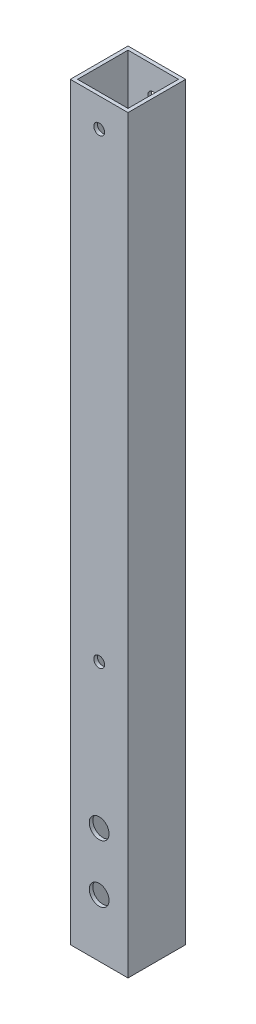
ISO-10303-21;
HEADER;
FILE_DESCRIPTION(('STEP AP214'),'2;1');
FILE_NAME('part.step','',(''),(''),'','','');
FILE_SCHEMA(('AUTOMOTIVE_DESIGN { 1 0 10303 214 1 1 1 1 }'));
ENDSEC;
DATA;
#1=APPLICATION_CONTEXT('core data for automotive mechanical design processes');
#2=APPLICATION_PROTOCOL_DEFINITION('international standard','automotive_design',2000,#1);
#3=PRODUCT_CONTEXT('',#1,'mechanical');
#4=PRODUCT('Part','Part','',(#3));
#5=PRODUCT_RELATED_PRODUCT_CATEGORY('part','',(#4));
#6=PRODUCT_DEFINITION_FORMATION('','',#4);
#7=PRODUCT_DEFINITION_CONTEXT('part definition',#1,'design');
#8=PRODUCT_DEFINITION('design','',#6,#7);
#9=PRODUCT_DEFINITION_SHAPE('','',#8);
#10=(LENGTH_UNIT() NAMED_UNIT(*) SI_UNIT(.MILLI.,.METRE.));
#11=(NAMED_UNIT(*) PLANE_ANGLE_UNIT() SI_UNIT($,.RADIAN.));
#12=(NAMED_UNIT(*) SI_UNIT($,.STERADIAN.) SOLID_ANGLE_UNIT());
#13=UNCERTAINTY_MEASURE_WITH_UNIT(LENGTH_MEASURE(1.E-05),#10,'distance_accuracy_value','');
#14=(GEOMETRIC_REPRESENTATION_CONTEXT(3) GLOBAL_UNCERTAINTY_ASSIGNED_CONTEXT((#13)) GLOBAL_UNIT_ASSIGNED_CONTEXT((#10,
#11,#12)) REPRESENTATION_CONTEXT('',''));
#15=CARTESIAN_POINT('',(0.,0.,0.));
#16=DIRECTION('',(0.,0.,1.));
#17=DIRECTION('',(1.,0.,0.));
#18=AXIS2_PLACEMENT_3D('',#15,#16,#17);
#19=CARTESIAN_POINT('',(0.,330.2,0.));
#20=DIRECTION('',(0.,1.,0.));
#21=DIRECTION('',(0.,0.,1.));
#22=AXIS2_PLACEMENT_3D('',#19,#20,#21);
#23=PLANE('',#22);
#24=DIRECTION('',(0.,0.,1.));
#25=VECTOR('',#24,1.);
#26=CARTESIAN_POINT('',(-12.7,330.2,12.7));
#27=LINE('',#26,#25);
#28=CARTESIAN_POINT('',(-12.7,330.2,-12.7));
#29=VERTEX_POINT('',#28);
#30=CARTESIAN_POINT('',(-12.7,330.2,12.7));
#31=VERTEX_POINT('',#30);
#32=EDGE_CURVE('E137',#29,#31,#27,.T.);
#33=ORIENTED_EDGE('',*,*,#32,.T.);
#34=DIRECTION('',(1.,0.,0.));
#35=VECTOR('',#34,1.);
#36=CARTESIAN_POINT('',(12.7,330.2,12.7));
#37=LINE('',#36,#35);
#38=CARTESIAN_POINT('',(12.7,330.2,12.7));
#39=VERTEX_POINT('',#38);
#40=EDGE_CURVE('E140',#31,#39,#37,.T.);
#41=ORIENTED_EDGE('',*,*,#40,.T.);
#42=DIRECTION('',(0.,0.,-1.));
#43=VECTOR('',#42,1.);
#44=CARTESIAN_POINT('',(12.7,330.2,12.7));
#45=LINE('',#44,#43);
#46=CARTESIAN_POINT('',(12.7,330.2,-12.7));
#47=VERTEX_POINT('',#46);
#48=EDGE_CURVE('E143',#39,#47,#45,.T.);
#49=ORIENTED_EDGE('',*,*,#48,.T.);
#50=DIRECTION('',(-1.,0.,0.));
#51=VECTOR('',#50,1.);
#52=CARTESIAN_POINT('',(12.7,330.2,-12.7));
#53=LINE('',#52,#51);
#54=EDGE_CURVE('E145',#47,#29,#53,.T.);
#55=ORIENTED_EDGE('',*,*,#54,.T.);
#56=EDGE_LOOP('',(#33,#41,#49,#55));
#57=FACE_BOUND('',#56,.T.);
#58=DIRECTION('',(1.,0.,0.));
#59=VECTOR('',#58,1.);
#60=CARTESIAN_POINT('',(11.1125,330.2,11.1125));
#61=LINE('',#60,#59);
#62=CARTESIAN_POINT('',(-11.1125,330.2,11.1125));
#63=VERTEX_POINT('',#62);
#64=CARTESIAN_POINT('',(11.1125,330.2,11.1125));
#65=VERTEX_POINT('',#64);
#66=EDGE_CURVE('E107',#63,#65,#61,.T.);
#67=ORIENTED_EDGE('',*,*,#66,.F.);
#68=DIRECTION('',(0.,0.,1.));
#69=VECTOR('',#68,1.);
#70=CARTESIAN_POINT('',(-11.1125,330.2,11.1125));
#71=LINE('',#70,#69);
#72=CARTESIAN_POINT('',(-11.1125,330.2,-11.1125));
#73=VERTEX_POINT('',#72);
#74=EDGE_CURVE('E99',#73,#63,#71,.T.);
#75=ORIENTED_EDGE('',*,*,#74,.F.);
#76=DIRECTION('',(-1.,0.,0.));
#77=VECTOR('',#76,1.);
#78=CARTESIAN_POINT('',(11.1125,330.2,-11.1125));
#79=LINE('',#78,#77);
#80=CARTESIAN_POINT('',(11.1125,330.2,-11.1125));
#81=VERTEX_POINT('',#80);
#82=EDGE_CURVE('E121',#81,#73,#79,.T.);
#83=ORIENTED_EDGE('',*,*,#82,.F.);
#84=DIRECTION('',(0.,0.,-1.));
#85=VECTOR('',#84,1.);
#86=CARTESIAN_POINT('',(11.1125,330.2,11.1125));
#87=LINE('',#86,#85);
#88=EDGE_CURVE('E119',#65,#81,#87,.T.);
#89=ORIENTED_EDGE('',*,*,#88,.F.);
#90=EDGE_LOOP('',(#67,#75,#83,#89));
#91=FACE_BOUND('',#90,.T.);
#92=ADVANCED_FACE('F32',(#57,#91),#23,.T.);
#93=CARTESIAN_POINT('',(0.,0.,0.));
#94=DIRECTION('',(0.,1.,0.));
#95=DIRECTION('',(0.,0.,1.));
#96=AXIS2_PLACEMENT_3D('',#93,#94,#95);
#97=PLANE('',#96);
#98=DIRECTION('',(0.,0.,1.));
#99=VECTOR('',#98,1.);
#100=CARTESIAN_POINT('',(-12.7,0.,12.7));
#101=LINE('',#100,#99);
#102=CARTESIAN_POINT('',(-12.7,0.,-12.7));
#103=VERTEX_POINT('',#102);
#104=CARTESIAN_POINT('',(-12.7,0.,12.7));
#105=VERTEX_POINT('',#104);
#106=EDGE_CURVE('E115',#103,#105,#101,.T.);
#107=ORIENTED_EDGE('',*,*,#106,.F.);
#108=DIRECTION('',(-1.,0.,0.));
#109=VECTOR('',#108,1.);
#110=CARTESIAN_POINT('',(12.7,0.,-12.7));
#111=LINE('',#110,#109);
#112=CARTESIAN_POINT('',(12.7,0.,-12.7));
#113=VERTEX_POINT('',#112);
#114=EDGE_CURVE('E141',#113,#103,#111,.T.);
#115=ORIENTED_EDGE('',*,*,#114,.F.);
#116=DIRECTION('',(0.,0.,-1.));
#117=VECTOR('',#116,1.);
#118=CARTESIAN_POINT('',(12.7,0.,12.7));
#119=LINE('',#118,#117);
#120=CARTESIAN_POINT('',(12.7,0.,12.7));
#121=VERTEX_POINT('',#120);
#122=EDGE_CURVE('E152',#121,#113,#119,.T.);
#123=ORIENTED_EDGE('',*,*,#122,.F.);
#124=DIRECTION('',(1.,0.,0.));
#125=VECTOR('',#124,1.);
#126=CARTESIAN_POINT('',(12.7,0.,12.7));
#127=LINE('',#126,#125);
#128=EDGE_CURVE('E150',#105,#121,#127,.T.);
#129=ORIENTED_EDGE('',*,*,#128,.F.);
#130=EDGE_LOOP('',(#107,#115,#123,#129));
#131=FACE_BOUND('',#130,.T.);
#132=DIRECTION('',(0.,0.,1.));
#133=VECTOR('',#132,1.);
#134=CARTESIAN_POINT('',(-11.1125,0.,11.1125));
#135=LINE('',#134,#133);
#136=CARTESIAN_POINT('',(-11.1125,0.,-11.1125));
#137=VERTEX_POINT('',#136);
#138=CARTESIAN_POINT('',(-11.1125,0.,11.1125));
#139=VERTEX_POINT('',#138);
#140=EDGE_CURVE('E57',#137,#139,#135,.T.);
#141=ORIENTED_EDGE('',*,*,#140,.T.);
#142=DIRECTION('',(1.,0.,0.));
#143=VECTOR('',#142,1.);
#144=CARTESIAN_POINT('',(11.1125,0.,11.1125));
#145=LINE('',#144,#143);
#146=CARTESIAN_POINT('',(11.1125,0.,11.1125));
#147=VERTEX_POINT('',#146);
#148=EDGE_CURVE('E114',#139,#147,#145,.T.);
#149=ORIENTED_EDGE('',*,*,#148,.T.);
#150=DIRECTION('',(0.,0.,-1.));
#151=VECTOR('',#150,1.);
#152=CARTESIAN_POINT('',(11.1125,0.,11.1125));
#153=LINE('',#152,#151);
#154=CARTESIAN_POINT('',(11.1125,0.,-11.1125));
#155=VERTEX_POINT('',#154);
#156=EDGE_CURVE('E129',#147,#155,#153,.T.);
#157=ORIENTED_EDGE('',*,*,#156,.T.);
#158=DIRECTION('',(-1.,0.,0.));
#159=VECTOR('',#158,1.);
#160=CARTESIAN_POINT('',(11.1125,0.,-11.1125));
#161=LINE('',#160,#159);
#162=EDGE_CURVE('E108',#155,#137,#161,.T.);
#163=ORIENTED_EDGE('',*,*,#162,.T.);
#164=EDGE_LOOP('',(#141,#149,#157,#163));
#165=FACE_BOUND('',#164,.T.);
#166=ADVANCED_FACE('F204',(#131,#165),#97,.F.);
#167=CARTESIAN_POINT('',(-12.7,330.2,12.7));
#168=DIRECTION('',(1.,0.,0.));
#169=DIRECTION('',(0.,0.,-1.));
#170=AXIS2_PLACEMENT_3D('',#167,#168,#169);
#171=PLANE('',#170);
#172=ORIENTED_EDGE('',*,*,#106,.T.);
#173=DIRECTION('',(0.,-1.,0.));
#174=VECTOR('',#173,1.);
#175=CARTESIAN_POINT('',(-12.7,330.2,12.7));
#176=LINE('',#175,#174);
#177=EDGE_CURVE('E11',#31,#105,#176,.T.);
#178=ORIENTED_EDGE('',*,*,#177,.F.);
#179=ORIENTED_EDGE('',*,*,#32,.F.);
#180=DIRECTION('',(0.,-1.,0.));
#181=VECTOR('',#180,1.);
#182=CARTESIAN_POINT('',(-12.7,330.2,-12.7));
#183=LINE('',#182,#181);
#184=EDGE_CURVE('E147',#29,#103,#183,.T.);
#185=ORIENTED_EDGE('',*,*,#184,.T.);
#186=EDGE_LOOP('',(#172,#178,#179,#185));
#187=FACE_BOUND('',#186,.T.);
#188=ADVANCED_FACE('F34',(#187),#171,.F.);
#189=CARTESIAN_POINT('',(12.7,330.2,12.7));
#190=DIRECTION('',(0.,0.,-1.));
#191=DIRECTION('',(-1.,0.,0.));
#192=AXIS2_PLACEMENT_3D('',#189,#190,#191);
#193=PLANE('',#192);
#194=CARTESIAN_POINT('',(0.,25.4,12.7));
#195=DIRECTION('',(0.,0.,1.));
#196=DIRECTION('',(1.,0.,0.));
#197=AXIS2_PLACEMENT_3D('',#194,#195,#196);
#198=CIRCLE('',#197,4.365625);
#199=CARTESIAN_POINT('',(4.36562500000004,25.4,12.7));
#200=VERTEX_POINT('',#199);
#201=EDGE_CURVE('E240',#200,#200,#198,.T.);
#202=ORIENTED_EDGE('',*,*,#201,.F.);
#203=EDGE_LOOP('',(#202));
#204=FACE_BOUND('',#203,.T.);
#205=CARTESIAN_POINT('',(0.,114.3,12.7));
#206=DIRECTION('',(0.,0.,1.));
#207=DIRECTION('',(1.,0.,0.));
#208=AXIS2_PLACEMENT_3D('',#205,#206,#207);
#209=CIRCLE('',#208,2.38125);
#210=CARTESIAN_POINT('',(2.38125000000003,114.3,12.7));
#211=VERTEX_POINT('',#210);
#212=EDGE_CURVE('E244',#211,#211,#209,.T.);
#213=ORIENTED_EDGE('',*,*,#212,.F.);
#214=EDGE_LOOP('',(#213));
#215=FACE_BOUND('',#214,.T.);
#216=CARTESIAN_POINT('',(0.,317.5,12.7));
#217=DIRECTION('',(0.,0.,1.));
#218=DIRECTION('',(1.,0.,0.));
#219=AXIS2_PLACEMENT_3D('',#216,#217,#218);
#220=CIRCLE('',#219,2.38125000000001);
#221=CARTESIAN_POINT('',(2.38125000000001,317.5,12.7));
#222=VERTEX_POINT('',#221);
#223=EDGE_CURVE('E248',#222,#222,#220,.T.);
#224=ORIENTED_EDGE('',*,*,#223,.F.);
#225=EDGE_LOOP('',(#224));
#226=FACE_BOUND('',#225,.T.);
#227=CARTESIAN_POINT('',(0.,50.8,12.7));
#228=DIRECTION('',(0.,0.,1.));
#229=DIRECTION('',(1.,0.,0.));
#230=AXIS2_PLACEMENT_3D('',#227,#228,#229);
#231=CIRCLE('',#230,4.365625);
#232=CARTESIAN_POINT('',(4.36562500000004,50.8,12.7));
#233=VERTEX_POINT('',#232);
#234=EDGE_CURVE('E252',#233,#233,#231,.T.);
#235=ORIENTED_EDGE('',*,*,#234,.F.);
#236=EDGE_LOOP('',(#235));
#237=FACE_BOUND('',#236,.T.);
#238=ORIENTED_EDGE('',*,*,#128,.T.);
#239=DIRECTION('',(0.,-1.,0.));
#240=VECTOR('',#239,1.);
#241=CARTESIAN_POINT('',(12.7,330.2,12.7));
#242=LINE('',#241,#240);
#243=EDGE_CURVE('E41',#39,#121,#242,.T.);
#244=ORIENTED_EDGE('',*,*,#243,.F.);
#245=ORIENTED_EDGE('',*,*,#40,.F.);
#246=ORIENTED_EDGE('',*,*,#177,.T.);
#247=EDGE_LOOP('',(#238,#244,#245,#246));
#248=FACE_BOUND('',#247,.T.);
#249=ADVANCED_FACE('F229',(#204,#215,#226,#237,#248),#193,.F.);
#250=CARTESIAN_POINT('',(12.7,330.2,12.7));
#251=DIRECTION('',(-1.,0.,0.));
#252=DIRECTION('',(0.,0.,1.));
#253=AXIS2_PLACEMENT_3D('',#250,#251,#252);
#254=PLANE('',#253);
#255=ORIENTED_EDGE('',*,*,#122,.T.);
#256=DIRECTION('',(0.,-1.,0.));
#257=VECTOR('',#256,1.);
#258=CARTESIAN_POINT('',(12.7,330.2,-12.7));
#259=LINE('',#258,#257);
#260=EDGE_CURVE('E157',#47,#113,#259,.T.);
#261=ORIENTED_EDGE('',*,*,#260,.F.);
#262=ORIENTED_EDGE('',*,*,#48,.F.);
#263=ORIENTED_EDGE('',*,*,#243,.T.);
#264=EDGE_LOOP('',(#255,#261,#262,#263));
#265=FACE_BOUND('',#264,.T.);
#266=ADVANCED_FACE('F226',(#265),#254,.F.);
#267=CARTESIAN_POINT('',(12.7,330.2,-12.7));
#268=DIRECTION('',(0.,0.,1.));
#269=DIRECTION('',(1.,0.,0.));
#270=AXIS2_PLACEMENT_3D('',#267,#268,#269);
#271=PLANE('',#270);
#272=CARTESIAN_POINT('',(0.,25.4,-12.7));
#273=DIRECTION('',(0.,0.,1.));
#274=DIRECTION('',(1.,0.,0.));
#275=AXIS2_PLACEMENT_3D('',#272,#273,#274);
#276=CIRCLE('',#275,4.365625);
#277=CARTESIAN_POINT('',(4.36562500000004,25.4,-12.7));
#278=VERTEX_POINT('',#277);
#279=EDGE_CURVE('E166',#278,#278,#276,.F.);
#280=ORIENTED_EDGE('',*,*,#279,.F.);
#281=EDGE_LOOP('',(#280));
#282=FACE_BOUND('',#281,.T.);
#283=CARTESIAN_POINT('',(0.,114.3,-12.7));
#284=DIRECTION('',(0.,0.,1.));
#285=DIRECTION('',(1.,0.,0.));
#286=AXIS2_PLACEMENT_3D('',#283,#284,#285);
#287=CIRCLE('',#286,2.38125);
#288=CARTESIAN_POINT('',(2.38125000000003,114.3,-12.7));
#289=VERTEX_POINT('',#288);
#290=EDGE_CURVE('E272',#289,#289,#287,.F.);
#291=ORIENTED_EDGE('',*,*,#290,.F.);
#292=EDGE_LOOP('',(#291));
#293=FACE_BOUND('',#292,.T.);
#294=CARTESIAN_POINT('',(0.,317.5,-12.7));
#295=DIRECTION('',(0.,0.,1.));
#296=DIRECTION('',(1.,0.,0.));
#297=AXIS2_PLACEMENT_3D('',#294,#295,#296);
#298=CIRCLE('',#297,2.38125000000001);
#299=CARTESIAN_POINT('',(2.38125000000001,317.5,-12.7));
#300=VERTEX_POINT('',#299);
#301=EDGE_CURVE('E266',#300,#300,#298,.F.);
#302=ORIENTED_EDGE('',*,*,#301,.F.);
#303=EDGE_LOOP('',(#302));
#304=FACE_BOUND('',#303,.T.);
#305=CARTESIAN_POINT('',(0.,50.8,-12.7));
#306=DIRECTION('',(0.,0.,1.));
#307=DIRECTION('',(1.,0.,0.));
#308=AXIS2_PLACEMENT_3D('',#305,#306,#307);
#309=CIRCLE('',#308,4.365625);
#310=CARTESIAN_POINT('',(4.36562500000004,50.8,-12.7));
#311=VERTEX_POINT('',#310);
#312=EDGE_CURVE('E265',#311,#311,#309,.F.);
#313=ORIENTED_EDGE('',*,*,#312,.F.);
#314=EDGE_LOOP('',(#313));
#315=FACE_BOUND('',#314,.T.);
#316=ORIENTED_EDGE('',*,*,#114,.T.);
#317=ORIENTED_EDGE('',*,*,#184,.F.);
#318=ORIENTED_EDGE('',*,*,#54,.F.);
#319=ORIENTED_EDGE('',*,*,#260,.T.);
#320=EDGE_LOOP('',(#316,#317,#318,#319));
#321=FACE_BOUND('',#320,.T.);
#322=ADVANCED_FACE('F223',(#282,#293,#304,#315,#321),#271,.F.);
#323=CARTESIAN_POINT('',(-11.1125,330.2,11.1125));
#324=DIRECTION('',(1.,0.,0.));
#325=DIRECTION('',(0.,0.,-1.));
#326=AXIS2_PLACEMENT_3D('',#323,#324,#325);
#327=PLANE('',#326);
#328=ORIENTED_EDGE('',*,*,#140,.F.);
#329=DIRECTION('',(0.,-1.,0.));
#330=VECTOR('',#329,1.);
#331=CARTESIAN_POINT('',(-11.1125,330.2,-11.1125));
#332=LINE('',#331,#330);
#333=EDGE_CURVE('E103',#73,#137,#332,.T.);
#334=ORIENTED_EDGE('',*,*,#333,.F.);
#335=ORIENTED_EDGE('',*,*,#74,.T.);
#336=DIRECTION('',(0.,-1.,0.));
#337=VECTOR('',#336,1.);
#338=CARTESIAN_POINT('',(-11.1125,330.2,11.1125));
#339=LINE('',#338,#337);
#340=EDGE_CURVE('E102',#63,#139,#339,.T.);
#341=ORIENTED_EDGE('',*,*,#340,.T.);
#342=EDGE_LOOP('',(#328,#334,#335,#341));
#343=FACE_BOUND('',#342,.T.);
#344=ADVANCED_FACE('F101',(#343),#327,.T.);
#345=CARTESIAN_POINT('',(11.1125,330.2,11.1125));
#346=DIRECTION('',(0.,0.,-1.));
#347=DIRECTION('',(-1.,0.,0.));
#348=AXIS2_PLACEMENT_3D('',#345,#346,#347);
#349=PLANE('',#348);
#350=CARTESIAN_POINT('',(0.,25.4,11.1125));
#351=DIRECTION('',(0.,0.,-1.));
#352=DIRECTION('',(-1.,0.,0.));
#353=AXIS2_PLACEMENT_3D('',#350,#351,#352);
#354=CIRCLE('',#353,4.365625);
#355=CARTESIAN_POINT('',(-4.36562499999996,25.4,11.1125));
#356=VERTEX_POINT('',#355);
#357=EDGE_CURVE('E127',#356,#356,#354,.T.);
#358=ORIENTED_EDGE('',*,*,#357,.F.);
#359=EDGE_LOOP('',(#358));
#360=FACE_BOUND('',#359,.T.);
#361=CARTESIAN_POINT('',(0.,114.3,11.1125));
#362=DIRECTION('',(0.,0.,-1.));
#363=DIRECTION('',(-1.,0.,0.));
#364=AXIS2_PLACEMENT_3D('',#361,#362,#363);
#365=CIRCLE('',#364,2.38125);
#366=CARTESIAN_POINT('',(-2.38124999999997,114.3,11.1125));
#367=VERTEX_POINT('',#366);
#368=EDGE_CURVE('E172',#367,#367,#365,.T.);
#369=ORIENTED_EDGE('',*,*,#368,.F.);
#370=EDGE_LOOP('',(#369));
#371=FACE_BOUND('',#370,.T.);
#372=CARTESIAN_POINT('',(0.,317.5,11.1125));
#373=DIRECTION('',(0.,0.,-1.));
#374=DIRECTION('',(-1.,0.,0.));
#375=AXIS2_PLACEMENT_3D('',#372,#373,#374);
#376=CIRCLE('',#375,2.38125000000001);
#377=CARTESIAN_POINT('',(-2.38125,317.5,11.1125));
#378=VERTEX_POINT('',#377);
#379=EDGE_CURVE('E169',#378,#378,#376,.T.);
#380=ORIENTED_EDGE('',*,*,#379,.F.);
#381=EDGE_LOOP('',(#380));
#382=FACE_BOUND('',#381,.T.);
#383=CARTESIAN_POINT('',(0.,50.8,11.1125));
#384=DIRECTION('',(0.,0.,-1.));
#385=DIRECTION('',(-1.,0.,0.));
#386=AXIS2_PLACEMENT_3D('',#383,#384,#385);
#387=CIRCLE('',#386,4.365625);
#388=CARTESIAN_POINT('',(-4.36562499999997,50.8,11.1125));
#389=VERTEX_POINT('',#388);
#390=EDGE_CURVE('E165',#389,#389,#387,.T.);
#391=ORIENTED_EDGE('',*,*,#390,.F.);
#392=EDGE_LOOP('',(#391));
#393=FACE_BOUND('',#392,.T.);
#394=ORIENTED_EDGE('',*,*,#148,.F.);
#395=ORIENTED_EDGE('',*,*,#340,.F.);
#396=ORIENTED_EDGE('',*,*,#66,.T.);
#397=DIRECTION('',(0.,-1.,0.));
#398=VECTOR('',#397,1.);
#399=CARTESIAN_POINT('',(11.1125,330.2,11.1125));
#400=LINE('',#399,#398);
#401=EDGE_CURVE('E116',#65,#147,#400,.T.);
#402=ORIENTED_EDGE('',*,*,#401,.T.);
#403=EDGE_LOOP('',(#394,#395,#396,#402));
#404=FACE_BOUND('',#403,.T.);
#405=ADVANCED_FACE('F111',(#360,#371,#382,#393,#404),#349,.T.);
#406=CARTESIAN_POINT('',(11.1125,330.2,11.1125));
#407=DIRECTION('',(-1.,0.,0.));
#408=DIRECTION('',(0.,0.,1.));
#409=AXIS2_PLACEMENT_3D('',#406,#407,#408);
#410=PLANE('',#409);
#411=ORIENTED_EDGE('',*,*,#156,.F.);
#412=ORIENTED_EDGE('',*,*,#401,.F.);
#413=ORIENTED_EDGE('',*,*,#88,.T.);
#414=DIRECTION('',(0.,-1.,0.));
#415=VECTOR('',#414,1.);
#416=CARTESIAN_POINT('',(11.1125,330.2,-11.1125));
#417=LINE('',#416,#415);
#418=EDGE_CURVE('E49',#81,#155,#417,.T.);
#419=ORIENTED_EDGE('',*,*,#418,.T.);
#420=EDGE_LOOP('',(#411,#412,#413,#419));
#421=FACE_BOUND('',#420,.T.);
#422=ADVANCED_FACE('F196',(#421),#410,.T.);
#423=CARTESIAN_POINT('',(11.1125,330.2,-11.1125));
#424=DIRECTION('',(0.,0.,1.));
#425=DIRECTION('',(1.,0.,0.));
#426=AXIS2_PLACEMENT_3D('',#423,#424,#425);
#427=PLANE('',#426);
#428=CARTESIAN_POINT('',(0.,25.4,-11.1125));
#429=DIRECTION('',(0.,0.,1.));
#430=DIRECTION('',(1.,0.,0.));
#431=AXIS2_PLACEMENT_3D('',#428,#429,#430);
#432=CIRCLE('',#431,4.365625);
#433=CARTESIAN_POINT('',(4.36562500000004,25.4,-11.1125));
#434=VERTEX_POINT('',#433);
#435=EDGE_CURVE('E36',#434,#434,#432,.T.);
#436=ORIENTED_EDGE('',*,*,#435,.F.);
#437=EDGE_LOOP('',(#436));
#438=FACE_BOUND('',#437,.T.);
#439=CARTESIAN_POINT('',(0.,114.3,-11.1125));
#440=DIRECTION('',(0.,0.,1.));
#441=DIRECTION('',(1.,0.,0.));
#442=AXIS2_PLACEMENT_3D('',#439,#440,#441);
#443=CIRCLE('',#442,2.38125);
#444=CARTESIAN_POINT('',(2.38125000000003,114.3,-11.1125));
#445=VERTEX_POINT('',#444);
#446=EDGE_CURVE('E170',#445,#445,#443,.T.);
#447=ORIENTED_EDGE('',*,*,#446,.F.);
#448=EDGE_LOOP('',(#447));
#449=FACE_BOUND('',#448,.T.);
#450=CARTESIAN_POINT('',(0.,317.5,-11.1125));
#451=DIRECTION('',(0.,0.,1.));
#452=DIRECTION('',(1.,0.,0.));
#453=AXIS2_PLACEMENT_3D('',#450,#451,#452);
#454=CIRCLE('',#453,2.38125000000001);
#455=CARTESIAN_POINT('',(2.38125000000001,317.5,-11.1125));
#456=VERTEX_POINT('',#455);
#457=EDGE_CURVE('E167',#456,#456,#454,.T.);
#458=ORIENTED_EDGE('',*,*,#457,.F.);
#459=EDGE_LOOP('',(#458));
#460=FACE_BOUND('',#459,.T.);
#461=CARTESIAN_POINT('',(0.,50.8,-11.1125));
#462=DIRECTION('',(0.,0.,1.));
#463=DIRECTION('',(1.,0.,0.));
#464=AXIS2_PLACEMENT_3D('',#461,#462,#463);
#465=CIRCLE('',#464,4.365625);
#466=CARTESIAN_POINT('',(4.36562500000004,50.8,-11.1125));
#467=VERTEX_POINT('',#466);
#468=EDGE_CURVE('E162',#467,#467,#465,.T.);
#469=ORIENTED_EDGE('',*,*,#468,.F.);
#470=EDGE_LOOP('',(#469));
#471=FACE_BOUND('',#470,.T.);
#472=ORIENTED_EDGE('',*,*,#162,.F.);
#473=ORIENTED_EDGE('',*,*,#418,.F.);
#474=ORIENTED_EDGE('',*,*,#82,.T.);
#475=ORIENTED_EDGE('',*,*,#333,.T.);
#476=EDGE_LOOP('',(#472,#473,#474,#475));
#477=FACE_BOUND('',#476,.T.);
#478=ADVANCED_FACE('F192',(#438,#449,#460,#471,#477),#427,.T.);
#479=CARTESIAN_POINT('',(0.,50.8,-25.0478521664701));
#480=DIRECTION('',(0.,0.,1.));
#481=DIRECTION('',(1.,0.,0.));
#482=AXIS2_PLACEMENT_3D('',#479,#480,#481);
#483=CYLINDRICAL_SURFACE('',#482,4.365625);
#484=ORIENTED_EDGE('',*,*,#468,.T.);
#485=EDGE_LOOP('',(#484));
#486=FACE_BOUND('',#485,.T.);
#487=ORIENTED_EDGE('',*,*,#312,.T.);
#488=EDGE_LOOP('',(#487));
#489=FACE_BOUND('',#488,.T.);
#490=ADVANCED_FACE('F195',(#486,#489),#483,.F.);
#491=CARTESIAN_POINT('',(0.,317.5,-25.0478521664701));
#492=DIRECTION('',(0.,0.,1.));
#493=DIRECTION('',(1.,0.,0.));
#494=AXIS2_PLACEMENT_3D('',#491,#492,#493);
#495=CYLINDRICAL_SURFACE('',#494,2.38125000000001);
#496=ORIENTED_EDGE('',*,*,#457,.T.);
#497=EDGE_LOOP('',(#496));
#498=FACE_BOUND('',#497,.T.);
#499=ORIENTED_EDGE('',*,*,#301,.T.);
#500=EDGE_LOOP('',(#499));
#501=FACE_BOUND('',#500,.T.);
#502=ADVANCED_FACE('F303',(#498,#501),#495,.F.);
#503=CARTESIAN_POINT('',(0.,114.3,-25.0478521664701));
#504=DIRECTION('',(0.,0.,1.));
#505=DIRECTION('',(1.,0.,0.));
#506=AXIS2_PLACEMENT_3D('',#503,#504,#505);
#507=CYLINDRICAL_SURFACE('',#506,2.38125);
#508=ORIENTED_EDGE('',*,*,#446,.T.);
#509=EDGE_LOOP('',(#508));
#510=FACE_BOUND('',#509,.T.);
#511=ORIENTED_EDGE('',*,*,#290,.T.);
#512=EDGE_LOOP('',(#511));
#513=FACE_BOUND('',#512,.T.);
#514=ADVANCED_FACE('F294',(#510,#513),#507,.F.);
#515=CARTESIAN_POINT('',(0.,25.4,-25.0478521664701));
#516=DIRECTION('',(0.,0.,1.));
#517=DIRECTION('',(1.,0.,0.));
#518=AXIS2_PLACEMENT_3D('',#515,#516,#517);
#519=CYLINDRICAL_SURFACE('',#518,4.365625);
#520=ORIENTED_EDGE('',*,*,#435,.T.);
#521=EDGE_LOOP('',(#520));
#522=FACE_BOUND('',#521,.T.);
#523=ORIENTED_EDGE('',*,*,#279,.T.);
#524=EDGE_LOOP('',(#523));
#525=FACE_BOUND('',#524,.T.);
#526=ADVANCED_FACE('F189',(#522,#525),#519,.F.);
#527=ORIENTED_EDGE('',*,*,#390,.T.);
#528=EDGE_LOOP('',(#527));
#529=FACE_BOUND('',#528,.T.);
#530=ORIENTED_EDGE('',*,*,#234,.T.);
#531=EDGE_LOOP('',(#530));
#532=FACE_BOUND('',#531,.T.);
#533=ADVANCED_FACE('F296',(#529,#532),#483,.F.);
#534=ORIENTED_EDGE('',*,*,#379,.T.);
#535=EDGE_LOOP('',(#534));
#536=FACE_BOUND('',#535,.T.);
#537=ORIENTED_EDGE('',*,*,#223,.T.);
#538=EDGE_LOOP('',(#537));
#539=FACE_BOUND('',#538,.T.);
#540=ADVANCED_FACE('F291',(#536,#539),#495,.F.);
#541=ORIENTED_EDGE('',*,*,#368,.T.);
#542=EDGE_LOOP('',(#541));
#543=FACE_BOUND('',#542,.T.);
#544=ORIENTED_EDGE('',*,*,#212,.T.);
#545=EDGE_LOOP('',(#544));
#546=FACE_BOUND('',#545,.T.);
#547=ADVANCED_FACE('F286',(#543,#546),#507,.F.);
#548=ORIENTED_EDGE('',*,*,#357,.T.);
#549=EDGE_LOOP('',(#548));
#550=FACE_BOUND('',#549,.T.);
#551=ORIENTED_EDGE('',*,*,#201,.T.);
#552=EDGE_LOOP('',(#551));
#553=FACE_BOUND('',#552,.T.);
#554=ADVANCED_FACE('F284',(#550,#553),#519,.F.);
#555=CLOSED_SHELL('',(#92,#166,#188,#249,#266,#322,#344,#405,#422,#478,#490,#502,#514,#526,#533,
#540,#547,#554));
#556=MANIFOLD_SOLID_BREP('B2',#555);
#557=ADVANCED_BREP_SHAPE_REPRESENTATION('',(#18,#556),#14);
#558=SHAPE_DEFINITION_REPRESENTATION(#9,#557);
ENDSEC;
END-ISO-10303-21;
